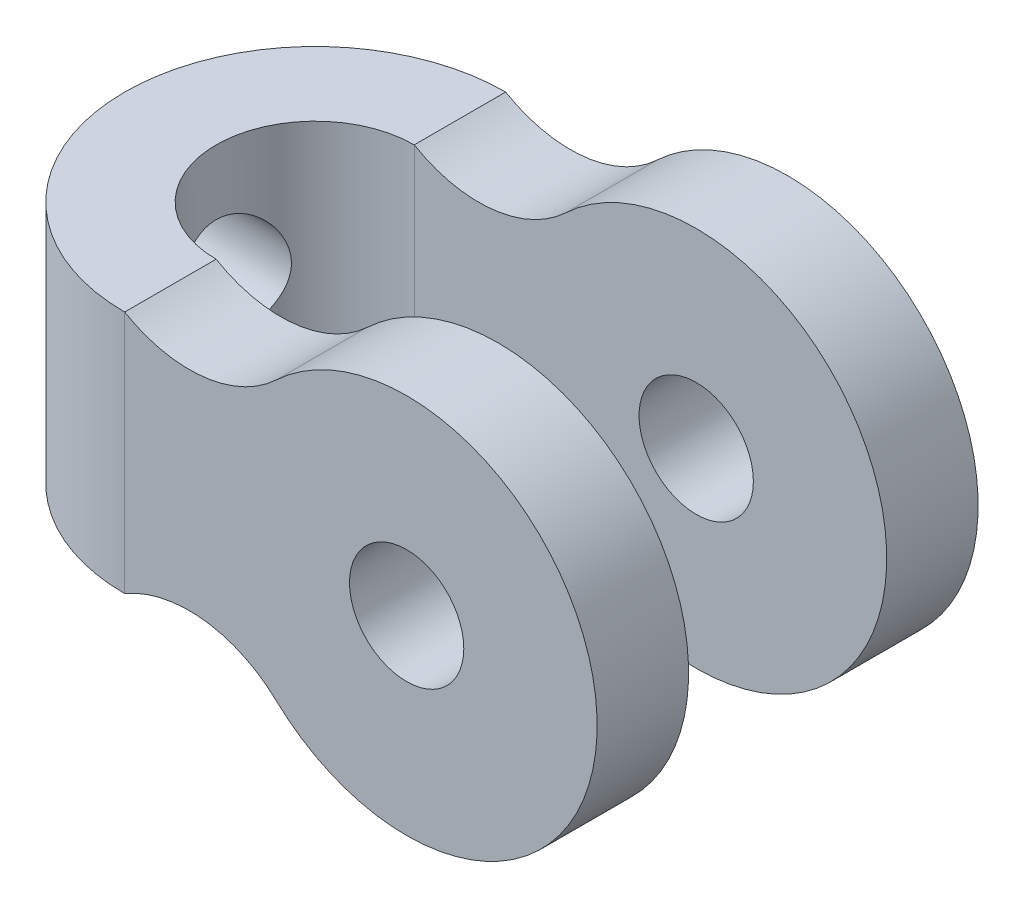
ISO-10303-21;
HEADER;
FILE_DESCRIPTION(('STEP AP214'),'2;1');
FILE_NAME('part.step','',(''),(''),'','','');
FILE_SCHEMA(('AUTOMOTIVE_DESIGN { 1 0 10303 214 1 1 1 1 }'));
ENDSEC;
DATA;
#1=APPLICATION_CONTEXT('core data for automotive mechanical design processes');
#2=APPLICATION_PROTOCOL_DEFINITION('international standard','automotive_design',2000,#1);
#3=PRODUCT_CONTEXT('',#1,'mechanical');
#4=PRODUCT('Part','Part','',(#3));
#5=PRODUCT_RELATED_PRODUCT_CATEGORY('part','',(#4));
#6=PRODUCT_DEFINITION_FORMATION('','',#4);
#7=PRODUCT_DEFINITION_CONTEXT('part definition',#1,'design');
#8=PRODUCT_DEFINITION('design','',#6,#7);
#9=PRODUCT_DEFINITION_SHAPE('','',#8);
#10=(LENGTH_UNIT() NAMED_UNIT(*) SI_UNIT(.MILLI.,.METRE.));
#11=(NAMED_UNIT(*) PLANE_ANGLE_UNIT() SI_UNIT($,.RADIAN.));
#12=(NAMED_UNIT(*) SI_UNIT($,.STERADIAN.) SOLID_ANGLE_UNIT());
#13=UNCERTAINTY_MEASURE_WITH_UNIT(LENGTH_MEASURE(1.E-05),#10,'distance_accuracy_value','');
#14=(GEOMETRIC_REPRESENTATION_CONTEXT(3) GLOBAL_UNCERTAINTY_ASSIGNED_CONTEXT((#13)) GLOBAL_UNIT_ASSIGNED_CONTEXT((#10,
#11,#12)) REPRESENTATION_CONTEXT('',''));
#15=CARTESIAN_POINT('',(0.,0.,0.));
#16=DIRECTION('',(0.,0.,1.));
#17=DIRECTION('',(1.,0.,0.));
#18=AXIS2_PLACEMENT_3D('',#15,#16,#17);
#19=CARTESIAN_POINT('',(37.,0.,13.));
#20=DIRECTION('',(0.,0.,1.));
#21=DIRECTION('',(1.,0.,0.));
#22=AXIS2_PLACEMENT_3D('',#19,#20,#21);
#23=CYLINDRICAL_SURFACE('',#22,25.);
#24=CARTESIAN_POINT('',(37.,0.,25.));
#25=DIRECTION('',(0.,0.,-1.));
#26=DIRECTION('',(-1.,0.,0.));
#27=AXIS2_PLACEMENT_3D('',#24,#25,#26);
#28=CIRCLE('',#27,25.);
#29=CARTESIAN_POINT('',(19.8821769608926,-18.2203220169624,25.));
#30=VERTEX_POINT('',#29);
#31=CARTESIAN_POINT('',(19.8821769608926,18.2203220169624,25.));
#32=VERTEX_POINT('',#31);
#33=EDGE_CURVE('E192',#30,#32,#28,.F.);
#34=ORIENTED_EDGE('',*,*,#33,.F.);
#35=DIRECTION('',(0.,0.,1.));
#36=VECTOR('',#35,1.);
#37=CARTESIAN_POINT('',(19.8821769608926,-18.2203220169624,13.));
#38=LINE('',#37,#36);
#39=CARTESIAN_POINT('',(19.8821769608926,-18.2203220169624,13.));
#40=VERTEX_POINT('',#39);
#41=EDGE_CURVE('E164',#40,#30,#38,.T.);
#42=ORIENTED_EDGE('',*,*,#41,.F.);
#43=CARTESIAN_POINT('',(37.,0.,13.));
#44=DIRECTION('',(0.,0.,1.));
#45=DIRECTION('',(1.,0.,0.));
#46=AXIS2_PLACEMENT_3D('',#43,#44,#45);
#47=CIRCLE('',#46,25.);
#48=CARTESIAN_POINT('',(19.8821769608926,18.2203220169624,13.));
#49=VERTEX_POINT('',#48);
#50=EDGE_CURVE('E220',#40,#49,#47,.T.);
#51=ORIENTED_EDGE('',*,*,#50,.T.);
#52=DIRECTION('',(0.,0.,1.));
#53=VECTOR('',#52,1.);
#54=CARTESIAN_POINT('',(19.8821769608926,18.2203220169624,13.));
#55=LINE('',#54,#53);
#56=EDGE_CURVE('E170',#49,#32,#55,.T.);
#57=ORIENTED_EDGE('',*,*,#56,.T.);
#58=EDGE_LOOP('',(#34,#42,#51,#57));
#59=FACE_BOUND('',#58,.T.);
#60=ADVANCED_FACE('F43',(#59),#23,.T.);
#61=CARTESIAN_POINT('',(0.,16.,0.));
#62=DIRECTION('',(0.,-1.,0.));
#63=DIRECTION('',(0.,0.,-1.));
#64=AXIS2_PLACEMENT_3D('',#61,#62,#63);
#65=CYLINDRICAL_SURFACE('',#64,13.);
#66=CARTESIAN_POINT('',(-10.6183802907976,0.,-7.5));
#67=CARTESIAN_POINT('',(-10.6183807732845,0.19041493864219,-7.49999966819467));
#68=CARTESIAN_POINT('',(-10.6235212171883,0.380834479385284,-7.49273748241149));
#69=CARTESIAN_POINT('',(-10.6438617045529,0.760031999546681,-7.46381371356377));
#70=CARTESIAN_POINT('',(-10.6590621824787,0.948809907710637,-7.44215150860183));
#71=CARTESIAN_POINT('',(-10.6989006729059,1.32332067001698,-7.38476397169863));
#72=CARTESIAN_POINT('',(-10.7235450117962,1.50905139570591,-7.34902921218797));
#73=CARTESIAN_POINT('',(-10.7813217849438,1.87610679062922,-7.26400278215991));
#74=CARTESIAN_POINT('',(-10.8144581546176,2.05742937425146,-7.21470482534094));
#75=CARTESIAN_POINT('',(-10.8877729954379,2.41323481189422,-7.10357591816715));
#76=CARTESIAN_POINT('',(-10.92789956285,2.58775722040373,-7.04183685006481));
#77=CARTESIAN_POINT('',(-11.0141095193745,2.93055434858108,-6.90621811969161));
#78=CARTESIAN_POINT('',(-11.0601951249362,3.09882671343176,-6.83233393728798));
#79=CARTESIAN_POINT('',(-11.1570289857365,3.42842747066833,-6.67303361847131));
#80=CARTESIAN_POINT('',(-11.207777239314,3.58975586552811,-6.58761748616676));
#81=CARTESIAN_POINT('',(-11.3126561254572,3.90490349536067,-6.40584552670437));
#82=CARTESIAN_POINT('',(-11.3667868729411,4.05872247488934,-6.30948932777393));
#83=CARTESIAN_POINT('',(-11.5448314170085,4.54194109280896,-5.98186886151761));
#84=CARTESIAN_POINT('',(-11.6731427416843,4.85606136912108,-5.7297061613543));
#85=CARTESIAN_POINT('',(-11.8642037234057,5.29401171734604,-5.31637918466528));
#86=CARTESIAN_POINT('',(-11.9276980183578,5.43453895844709,-5.1726494024848));
#87=CARTESIAN_POINT('',(-12.0528738313731,5.7040348389805,-4.87385116958035));
#88=CARTESIAN_POINT('',(-12.1145550289413,5.83300144303936,-4.71878073090548));
#89=CARTESIAN_POINT('',(-12.2405516102481,6.09056052111627,-4.38226657725949));
#90=CARTESIAN_POINT('',(-12.304535451984,6.21788504679745,-4.1997264426894));
#91=CARTESIAN_POINT('',(-12.4268192961067,6.45649492536812,-3.82274776060878));
#92=CARTESIAN_POINT('',(-12.4851218073375,6.56778736841658,-3.62831452733411));
#93=CARTESIAN_POINT('',(-12.5943838585164,6.77318727562475,-3.22868157743215));
#94=CARTESIAN_POINT('',(-12.6453461951346,6.8673012885877,-3.02348600221753));
#95=CARTESIAN_POINT('',(-12.7384034854798,7.03718531993501,-2.60370265286984));
#96=CARTESIAN_POINT('',(-12.7804997630478,7.11295807720793,-2.38911628671594));
#97=CARTESIAN_POINT('',(-12.8511543829347,7.23910516709274,-1.97192699534729));
#98=CARTESIAN_POINT('',(-12.8805885431219,7.29114841011263,-1.76997651445144));
#99=CARTESIAN_POINT('',(-12.9301624843343,7.37837334762997,-1.36133812967338));
#100=CARTESIAN_POINT('',(-12.950302773278,7.41355596358009,-1.15465048532965));
#101=CARTESIAN_POINT('',(-12.9806835689507,7.46649956855902,-0.738481152022394));
#102=CARTESIAN_POINT('',(-12.9909311034133,7.48427292511823,-0.529001553849871));
#103=CARTESIAN_POINT('',(-13.0012387635932,7.50215074414817,-0.109046725933166));
#104=CARTESIAN_POINT('',(-13.0012998132551,7.50225680909508,0.10142841178081));
#105=CARTESIAN_POINT('',(-12.9918190075501,7.48581274345954,0.497196756927199));
#106=CARTESIAN_POINT('',(-12.9833816853487,7.47117841836563,0.682599912329673));
#107=CARTESIAN_POINT('',(-12.9587382874924,7.42827085619351,1.05130069464922));
#108=CARTESIAN_POINT('',(-12.9425322127969,7.39999762079933,1.23459832182626));
#109=CARTESIAN_POINT('',(-12.9027272780067,7.33015642261091,1.59781440608292));
#110=CARTESIAN_POINT('',(-12.8791285191231,7.28858864182821,1.7777329093894));
#111=CARTESIAN_POINT('',(-12.8250679928318,7.19263086224007,2.1330575063129));
#112=CARTESIAN_POINT('',(-12.7946059494466,7.13824034781934,2.30846341815933));
#113=CARTESIAN_POINT('',(-12.7271977332188,7.01670449207594,2.65515810675736));
#114=CARTESIAN_POINT('',(-12.6902012193471,6.94945976555593,2.82640223732249));
#115=CARTESIAN_POINT('',(-12.6106632734052,6.80313068394007,3.16244205466241));
#116=CARTESIAN_POINT('',(-12.568119986805,6.72404236769158,3.32723556064202));
#117=CARTESIAN_POINT('',(-12.4334200083797,6.46998120820445,3.810740266032));
#118=CARTESIAN_POINT('',(-12.3341482448663,6.27813322215175,4.11879834222673));
#119=CARTESIAN_POINT('',(-12.1120235078011,5.83036672852847,4.73478776118259));
#120=CARTESIAN_POINT('',(-11.9877721123166,5.56963079495925,5.03867803627378));
#121=CARTESIAN_POINT('',(-11.7355475194831,5.00372696776813,5.60106376238731));
#122=CARTESIAN_POINT('',(-11.6075698656485,4.69850396243666,5.85950201702176));
#123=CARTESIAN_POINT('',(-11.4156710681088,4.19463045661562,6.22123453974022));
#124=CARTESIAN_POINT('',(-11.3487461710552,4.00952112112527,6.34215173818473));
#125=CARTESIAN_POINT('',(-11.2196388044965,3.62801777575609,6.56784437296249));
#126=CARTESIAN_POINT('',(-11.1574570159603,3.4316221525735,6.6726174936822));
#127=CARTESIAN_POINT('',(-11.0402389752531,3.02885054072663,6.86482290905135));
#128=CARTESIAN_POINT('',(-10.9851922902732,2.82248974350594,6.95228062301533));
#129=CARTESIAN_POINT('',(-10.8844744098571,2.40075844230142,7.10893121746259));
#130=CARTESIAN_POINT('',(-10.8387998581565,2.18539119700299,7.17813063898854));
#131=CARTESIAN_POINT('',(-10.7683068693668,1.79826985726795,7.28330846613391));
#132=CARTESIAN_POINT('',(-10.741108407342,1.62802156904908,7.32327016867799));
#133=CARTESIAN_POINT('',(-10.6943925611506,1.2841428773336,7.39132456729494));
#134=CARTESIAN_POINT('',(-10.6748736344111,1.11051316041919,7.41941964707608));
#135=CARTESIAN_POINT('',(-10.6442024248522,0.76111822604683,7.4633554965018));
#136=CARTESIAN_POINT('',(-10.6330432514836,0.585354888946761,7.47920635881199));
#137=CARTESIAN_POINT('',(-10.6194714222325,0.232801541741071,7.49846435645024));
#138=CARTESIAN_POINT('',(-10.6170589833592,0.0560115062717291,7.50187118303783));
#139=CARTESIAN_POINT('',(-10.6210733089797,-0.297389392710777,7.49618658229532));
#140=CARTESIAN_POINT('',(-10.6275062692243,-0.474000043832474,7.4870863944418));
#141=CARTESIAN_POINT('',(-10.6489828798288,-0.825611629774685,7.45650786858179));
#142=CARTESIAN_POINT('',(-10.6640265650146,-1.00061255808183,7.43502948051216));
#143=CARTESIAN_POINT('',(-10.7021944327085,-1.3478762615909,7.37998318477249));
#144=CARTESIAN_POINT('',(-10.7253221415322,-1.52013780751293,7.34641000106001));
#145=CARTESIAN_POINT('',(-10.7788910275016,-1.86086559721645,7.26758384002498));
#146=CARTESIAN_POINT('',(-10.8093351607168,-2.02933027677361,7.22232614123404));
#147=CARTESIAN_POINT('',(-10.8769235821627,-2.36314292441477,7.12013466551923));
#148=CARTESIAN_POINT('',(-10.9141298467574,-2.52844496687578,7.06309215519195));
#149=CARTESIAN_POINT('',(-10.993993793257,-2.85355107895792,6.93812631230225));
#150=CARTESIAN_POINT('',(-11.0366532702403,-3.01335331607886,6.87019939495599));
#151=CARTESIAN_POINT('',(-11.1711737985451,-3.48357585912023,6.65088677482425));
#152=CARTESIAN_POINT('',(-11.2696102177483,-3.78496769707846,6.48392094392949));
#153=CARTESIAN_POINT('',(-11.4929369573675,-4.40866927460059,6.08061958189599));
#154=CARTESIAN_POINT('',(-11.6194858676838,-4.72589805900425,5.83732800180829));
#155=CARTESIAN_POINT('',(-11.8092500331737,-5.16974059672925,5.43723733382179));
#156=CARTESIAN_POINT('',(-11.8725424699118,-5.31244993432602,5.29789683342313));
#157=CARTESIAN_POINT('',(-11.9977443085592,-5.58665970322304,5.00789809483656));
#158=CARTESIAN_POINT('',(-12.0596534767863,-5.71815825103709,4.85723796284391));
#159=CARTESIAN_POINT('',(-12.1870887411742,-5.98246752397188,4.52869861432382));
#160=CARTESIAN_POINT('',(-12.2523052239106,-6.11394710005013,4.34962570833819));
#161=CARTESIAN_POINT('',(-12.3775290331766,-6.36117757000874,3.97931566996771));
#162=CARTESIAN_POINT('',(-12.4375385647811,-6.47693513381053,3.78808374680637));
#163=CARTESIAN_POINT('',(-12.5506655924218,-6.69160111806925,3.39451000524366));
#164=CARTESIAN_POINT('',(-12.6037853624901,-6.79051510130219,3.19217188409198));
#165=CARTESIAN_POINT('',(-12.7015668248117,-6.97032968825142,2.77768160517893));
#166=CARTESIAN_POINT('',(-12.746229688782,-7.05123278767586,2.56553081205338));
#167=CARTESIAN_POINT('',(-12.8225030842756,-7.18815339623863,2.15042225396955));
#168=CARTESIAN_POINT('',(-12.8548728002512,-7.24564567161215,1.9480903408532));
#169=CARTESIAN_POINT('',(-12.910346486563,-7.34361492984538,1.53809311730334));
#170=CARTESIAN_POINT('',(-12.9334508818246,-7.38409269302724,1.33042805192327));
#171=CARTESIAN_POINT('',(-12.9696909071666,-7.4473858064178,0.911723943201735));
#172=CARTESIAN_POINT('',(-12.9828342433095,-7.47021481031298,0.700687637244094));
#173=CARTESIAN_POINT('',(-12.9987749140446,-7.49788508261704,0.277057522801693));
#174=CARTESIAN_POINT('',(-13.0015733157909,-7.50272820639845,0.064463877234799));
#175=CARTESIAN_POINT('',(-12.9970339320448,-7.49485764700523,-0.334763596103743));
#176=CARTESIAN_POINT('',(-12.9908707657702,-7.48417856911632,-0.521455025342119));
#177=CARTESIAN_POINT('',(-12.9706208706599,-7.44897407820879,-0.893095083989642));
#178=CARTESIAN_POINT('',(-12.9565342139207,-7.42444879117769,-1.07804372924092));
#179=CARTESIAN_POINT('',(-12.920770099743,-7.36185833862864,-1.44487550580922));
#180=CARTESIAN_POINT('',(-12.8990928679165,-7.32379357553909,-1.62675872807031));
#181=CARTESIAN_POINT('',(-12.8486446719631,-7.23457131967984,-1.98627484195547));
#182=CARTESIAN_POINT('',(-12.8198734557184,-7.18341336158008,-2.1639075822727));
#183=CARTESIAN_POINT('',(-12.7559206417195,-7.06864767231926,-2.51356571122269));
#184=CARTESIAN_POINT('',(-12.7207501988546,-7.00506159129491,-2.68560025269082));
#185=CARTESIAN_POINT('',(-12.6447006661188,-6.86599091290037,-3.02350672225573));
#186=CARTESIAN_POINT('',(-12.6038196785944,-6.79050235917817,-3.18937657849173));
#187=CARTESIAN_POINT('',(-12.4738165286567,-6.54713770566763,-3.67648840684472));
#188=CARTESIAN_POINT('',(-12.3772896621439,-6.36228481179263,-3.98746694772168));
#189=CARTESIAN_POINT('',(-12.160392680129,-5.92991787215349,-4.60923998766357));
#190=CARTESIAN_POINT('',(-12.0385679429097,-5.67774917190868,-4.91625561607505));
#191=CARTESIAN_POINT('',(-11.7897326234057,-5.12909624806626,-5.48624850647104));
#192=CARTESIAN_POINT('',(-11.6627160089419,-4.83255934657986,-5.74917262127669));
#193=CARTESIAN_POINT('',(-11.4703920901867,-4.34118298631901,-6.11983847563));
#194=CARTESIAN_POINT('',(-11.4027761188206,-4.15980833980046,-6.24457157532889));
#195=CARTESIAN_POINT('',(-11.2716579490527,-3.78562810488325,-6.47824413878931));
#196=CARTESIAN_POINT('',(-11.2081563262865,-3.59282092416278,-6.58718139519354));
#197=CARTESIAN_POINT('',(-11.0876060692604,-3.19695232669748,-6.78813090992248));
#198=CARTESIAN_POINT('',(-11.030549877751,-2.99390333133593,-6.88016307041553));
#199=CARTESIAN_POINT('',(-10.9251178485485,-2.57847007109373,-7.04638189554003));
#200=CARTESIAN_POINT('',(-10.8767393302622,-2.3660887143699,-7.12057407348521));
#201=CARTESIAN_POINT('',(-10.7996470938055,-1.97759480811,-7.23681160635666));
#202=CARTESIAN_POINT('',(-10.768935062906,-1.80291074893914,-7.2823269127617));
#203=CARTESIAN_POINT('',(-10.7154452477423,-1.44956481954899,-7.36080808911576));
#204=CARTESIAN_POINT('',(-10.6926658361999,-1.27090377316906,-7.39377653302634));
#205=CARTESIAN_POINT('',(-10.6558800290025,-0.910932746870917,-7.44669480155317));
#206=CARTESIAN_POINT('',(-10.6418654821224,-0.729625389090451,-7.46665672281359));
#207=CARTESIAN_POINT('',(-10.6231151706042,-0.365546811719532,-7.49330978284867));
#208=CARTESIAN_POINT('',(-10.6183798276681,-0.182775525978537,-7.50000031849336));
#209=CARTESIAN_POINT('',(-10.6183802907976,0.,-7.5));
#210=B_SPLINE_CURVE_WITH_KNOTS('',3,(#66,#67,#68,#69,#70,#71,#72,#73,#74,#75,#76,#77,#78,#79,
#80,#81,#82,#83,#84,#85,#86,#87,#88,#89,#90,#91,#92,#93,#94,#95,#96,#97,#98,#99,#100,#101,#102,
#103,#104,#105,#106,#107,#108,#109,#110,#111,#112,#113,#114,#115,#116,#117,#118,#119,#120,#121,
#122,#123,#124,#125,#126,#127,#128,#129,#130,#131,#132,#133,#134,#135,#136,#137,#138,#139,#140,
#141,#142,#143,#144,#145,#146,#147,#148,#149,#150,#151,#152,#153,#154,#155,#156,#157,#158,#159,
#160,#161,#162,#163,#164,#165,#166,#167,#168,#169,#170,#171,#172,#173,#174,#175,#176,#177,#178,
#179,#180,#181,#182,#183,#184,#185,#186,#187,#188,#189,#190,#191,#192,#193,#194,#195,#196,#197,
#198,#199,#200,#201,#202,#203,#204,#205,#206,#207,#208,#209),.UNSPECIFIED.,.T.,.F.,(4,2,2,2,2,2,
2,2,2,2,2,2,2,2,2,2,2,2,2,2,2,2,2,2,2,2,2,2,2,2,2,2,2,2,2,2,2,2,2,2,2,2,2,2,2,2,2,2,2,2,2,2,2,2,
2,2,2,2,2,2,2,2,2,2,2,2,2,2,2,2,2,4),(0.,0.571047958519108,1.14212058063765,1.71357643172915,
2.28529758996677,2.85294169157579,3.4207975376151,3.98865318134494,4.55652812810099,
5.81875278642569,6.45070375839378,7.08276577443935,7.77658944753256,8.47010533012133,
9.16335627416883,9.85650363152076,10.4874553426037,11.1183725675162,11.7488412633362,
12.3792527737292,12.9371007909577,13.4949487393074,14.0527890506596,14.6106517971715,
15.1730163044602,15.7355693194164,16.8599613721458,18.1129026768771,19.3674095618049,
20.0597007266966,20.7520910975976,21.4434573654992,22.1345756137431,22.6649609821717,
23.1952397586928,23.7250809691323,24.2549353250107,24.7851610059546,25.3153888313901,
25.8458482356629,26.3765223238945,26.9123308668427,27.4483162426421,28.519792718058,
29.7724549393759,30.3997303429854,31.0271109261444,31.7208217412166,32.4142373302951,
33.1074234652885,33.8005134879209,34.4380576082285,35.0755724861997,35.7125936658323,
36.3495491303358,36.9101659209783,37.4707776106157,38.0313726388099,38.5919875932289,
39.1516345077659,39.7114678412309,40.8303898228461,42.0723244640874,43.3157455168981,
44.0058560488693,44.6960629261525,45.3854519489514,46.0746276465965,46.6233639644327,
47.1719876494464,47.7201003589571,48.2682379773686),.UNSPECIFIED.);
#211=CARTESIAN_POINT('',(-10.6183802907976,0.,-7.5));
#212=VERTEX_POINT('',#211);
#213=EDGE_CURVE('E389',#212,#212,#210,.T.);
#214=ORIENTED_EDGE('',*,*,#213,.F.);
#215=EDGE_LOOP('',(#214));
#216=FACE_BOUND('',#215,.T.);
#217=CARTESIAN_POINT('',(0.,-16.,0.));
#218=DIRECTION('',(0.,1.,0.));
#219=DIRECTION('',(0.,0.,1.));
#220=AXIS2_PLACEMENT_3D('',#217,#218,#219);
#221=CIRCLE('',#220,13.);
#222=CARTESIAN_POINT('',(0.,-16.,-13.));
#223=VERTEX_POINT('',#222);
#224=CARTESIAN_POINT('',(0.,-16.,13.));
#225=VERTEX_POINT('',#224);
#226=EDGE_CURVE('E148',#223,#225,#221,.T.);
#227=ORIENTED_EDGE('',*,*,#226,.F.);
#228=DIRECTION('',(0.,-1.,0.));
#229=VECTOR('',#228,1.);
#230=CARTESIAN_POINT('',(0.,16.,-13.));
#231=LINE('',#230,#229);
#232=CARTESIAN_POINT('',(0.,16.,-13.));
#233=VERTEX_POINT('',#232);
#234=EDGE_CURVE('E57',#233,#223,#231,.T.);
#235=ORIENTED_EDGE('',*,*,#234,.F.);
#236=CARTESIAN_POINT('',(0.,16.,0.));
#237=DIRECTION('',(0.,1.,0.));
#238=DIRECTION('',(0.,0.,1.));
#239=AXIS2_PLACEMENT_3D('',#236,#237,#238);
#240=CIRCLE('',#239,13.);
#241=CARTESIAN_POINT('',(0.,16.,13.));
#242=VERTEX_POINT('',#241);
#243=EDGE_CURVE('E140',#233,#242,#240,.T.);
#244=ORIENTED_EDGE('',*,*,#243,.T.);
#245=DIRECTION('',(0.,-1.,0.));
#246=VECTOR('',#245,1.);
#247=CARTESIAN_POINT('',(0.,16.,13.));
#248=LINE('',#247,#246);
#249=EDGE_CURVE('E176',#242,#225,#248,.T.);
#250=ORIENTED_EDGE('',*,*,#249,.T.);
#251=EDGE_LOOP('',(#227,#235,#244,#250));
#252=FACE_BOUND('',#251,.T.);
#253=ADVANCED_FACE('F45',(#216,#252),#65,.F.);
#254=CARTESIAN_POINT('',(0.,16.,0.));
#255=DIRECTION('',(0.,-1.,0.));
#256=DIRECTION('',(0.,0.,-1.));
#257=AXIS2_PLACEMENT_3D('',#254,#255,#256);
#258=CYLINDRICAL_SURFACE('',#257,25.);
#259=CARTESIAN_POINT('',(-25.,-7.5,0.));
#260=CARTESIAN_POINT('',(-24.9999997387093,-7.49999958873744,-0.20572936877928));
#261=CARTESIAN_POINT('',(-24.9974544667338,-7.49152807475558,-0.411465831535254));
#262=CARTESIAN_POINT('',(-24.9873429572389,-7.45771851212328,-0.821427710156372));
#263=CARTESIAN_POINT('',(-24.979776490633,-7.43237969392028,-1.0256530566486));
#264=CARTESIAN_POINT('',(-24.9598298392335,-7.36506198897937,-1.43111710809401));
#265=CARTESIAN_POINT('',(-24.9474493245922,-7.32308196201924,-1.63235560741404));
#266=CARTESIAN_POINT('',(-24.918207039206,-7.22283446114039,-2.03047327493865));
#267=CARTESIAN_POINT('',(-24.901343610904,-7.16456096229754,-2.2273508014443));
#268=CARTESIAN_POINT('',(-24.8636236585512,-7.03233895758803,-2.61496608898178));
#269=CARTESIAN_POINT('',(-24.8427747095386,-6.95842015967178,-2.80571470813012));
#270=CARTESIAN_POINT('',(-24.7976165834664,-6.7954319444745,-3.18023152761331));
#271=CARTESIAN_POINT('',(-24.7733061064176,-6.70635683272393,-3.3639970724324));
#272=CARTESIAN_POINT('',(-24.6961258709879,-6.41741890217033,-3.9028968365555));
#273=CARTESIAN_POINT('',(-24.6389706824167,-6.19572053156255,-4.2459924930959));
#274=CARTESIAN_POINT('',(-24.5175228332811,-5.69380756937393,-4.89945628260249));
#275=CARTESIAN_POINT('',(-24.453083830256,-5.41222812637477,-5.20874876842761));
#276=CARTESIAN_POINT('',(-24.3572356846049,-4.95451799568009,-5.63438867316526));
#277=CARTESIAN_POINT('',(-24.3254023912414,-4.79595137800807,-5.76995575273776));
#278=CARTESIAN_POINT('',(-24.2628688644801,-4.46796267803007,-6.02749720979437));
#279=CARTESIAN_POINT('',(-24.2321682141076,-4.29854465472853,-6.14947662356303));
#280=CARTESIAN_POINT('',(-24.1720742886242,-3.94589029825538,-6.38165723915321));
#281=CARTESIAN_POINT('',(-24.1427271344006,-3.76242618681867,-6.49152422630404));
#282=CARTESIAN_POINT('',(-24.0870056696098,-3.38649865222216,-6.69532049323419));
#283=CARTESIAN_POINT('',(-24.0606302713012,-3.19403855856468,-6.78925561090326));
#284=CARTESIAN_POINT('',(-24.0116591700552,-2.80137736808001,-6.96047121789365));
#285=CARTESIAN_POINT('',(-23.9890634885817,-2.60117622730217,-7.03775161263955));
#286=CARTESIAN_POINT('',(-23.9483776131669,-2.19447382063703,-7.17498002551062));
#287=CARTESIAN_POINT('',(-23.9302872587357,-1.98797277946088,-7.23492866104505));
#288=CARTESIAN_POINT('',(-23.8996443649906,-1.57606890496715,-7.33550863488258));
#289=CARTESIAN_POINT('',(-23.8869510239055,-1.3707970470539,-7.37663359600348));
#290=CARTESIAN_POINT('',(-23.8667919187207,-0.957284784069786,-7.44159959786525));
#291=CARTESIAN_POINT('',(-23.8593259688078,-0.749044484783927,-7.46544125296127));
#292=CARTESIAN_POINT('',(-23.8498656440743,-0.331216759863733,-7.49560936672585));
#293=CARTESIAN_POINT('',(-23.8478701692626,-0.121629613547333,-7.50193934660578));
#294=CARTESIAN_POINT('',(-23.8494134610353,0.297315995670383,-7.49703176128155));
#295=CARTESIAN_POINT('',(-23.8529521082585,0.506674463406428,-7.48579457496972));
#296=CARTESIAN_POINT('',(-23.8652191979764,0.915974207495902,-7.44659064244469));
#297=CARTESIAN_POINT('',(-23.8737544360965,1.11598129684939,-7.41924647591029));
#298=CARTESIAN_POINT('',(-23.8956008797221,1.51295523472682,-7.3485797932839));
#299=CARTESIAN_POINT('',(-23.9089136782339,1.70992104630652,-7.3052519475377));
#300=CARTESIAN_POINT('',(-23.9399159878258,2.09934402861037,-7.20300430851475));
#301=CARTESIAN_POINT('',(-23.9576042240451,2.29180249478027,-7.14408905655662));
#302=CARTESIAN_POINT('',(-23.9968558467266,2.67108383112157,-7.01111349668661));
#303=CARTESIAN_POINT('',(-24.0184206964623,2.85790454205031,-6.93704746847458));
#304=CARTESIAN_POINT('',(-24.0651252156469,3.22710930200351,-6.77326301936971));
#305=CARTESIAN_POINT('',(-24.0903086714519,3.40940112154872,-6.68334926852301));
#306=CARTESIAN_POINT('',(-24.1433341783777,3.76585515047791,-6.48918645688073));
#307=CARTESIAN_POINT('',(-24.1711771400495,3.94001454490987,-6.38493248092123));
#308=CARTESIAN_POINT('',(-24.2287599493092,4.27910403458712,-6.1628198985473));
#309=CARTESIAN_POINT('',(-24.2584998559677,4.44403384212376,-6.04496086838063));
#310=CARTESIAN_POINT('',(-24.3190903696216,4.76369509186997,-5.79639580550814));
#311=CARTESIAN_POINT('',(-24.3499410080922,4.91842624472502,-5.66568940856087));
#312=CARTESIAN_POINT('',(-24.4132571587227,5.22304964855026,-5.38648407256465));
#313=CARTESIAN_POINT('',(-24.4457360934279,5.37246605566325,-5.23746854116016));
#314=CARTESIAN_POINT('',(-24.5101228223224,5.65822395788626,-4.92736681553845));
#315=CARTESIAN_POINT('',(-24.5420307974826,5.79456965779628,-4.76628453305944));
#316=CARTESIAN_POINT('',(-24.6044239714678,6.05338444200731,-4.43295367759993));
#317=CARTESIAN_POINT('',(-24.6349085356572,6.17584737069483,-4.26070020412312));
#318=CARTESIAN_POINT('',(-24.6935891394486,6.4059125570832,-3.90626478461736));
#319=CARTESIAN_POINT('',(-24.7217860748174,6.51352064318826,-3.72408677190493));
#320=CARTESIAN_POINT('',(-24.7753141715796,6.7138348498094,-3.34960172200364));
#321=CARTESIAN_POINT('',(-24.8006234400515,6.8064291155219,-3.15723166516043));
#322=CARTESIAN_POINT('',(-24.8474127214962,6.97498934178343,-2.76497276500567));
#323=CARTESIAN_POINT('',(-24.8688941908724,7.05096162919023,-2.56508681655161));
#324=CARTESIAN_POINT('',(-24.9074192341517,7.1856593933389,-2.15917205270828));
#325=CARTESIAN_POINT('',(-24.924462947231,7.24438541096311,-1.95314343019056));
#326=CARTESIAN_POINT('',(-24.9536132069595,7.34405113456182,-1.5364868020148));
#327=CARTESIAN_POINT('',(-24.9657199339043,7.38499149006096,-1.32585896461318));
#328=CARTESIAN_POINT('',(-24.9842982854925,7.44755116065808,-0.909255698841177));
#329=CARTESIAN_POINT('',(-24.9909565624248,7.46981118341934,-0.703384610254433));
#330=CARTESIAN_POINT('',(-24.9991662453924,7.49723188929537,-0.290406947188554));
#331=CARTESIAN_POINT('',(-25.0007177751984,7.50239298683127,-0.0833004027746441));
#332=CARTESIAN_POINT('',(-24.9986707577265,7.49556866355194,0.330578250504444));
#333=CARTESIAN_POINT('',(-24.9950728313054,7.48358530979956,0.537350396678168));
#334=CARTESIAN_POINT('',(-24.9828285304966,7.4425871577153,0.949046411046284));
#335=CARTESIAN_POINT('',(-24.9741821918165,7.41357247984682,1.15397029230313));
#336=CARTESIAN_POINT('',(-24.9523339609458,7.33963110490564,1.55582786425802));
#337=CARTESIAN_POINT('',(-24.9392404644237,7.29508240441682,1.75283719426588));
#338=CARTESIAN_POINT('',(-24.908801273421,7.19033319530745,2.14238229994045));
#339=CARTESIAN_POINT('',(-24.891454153274,7.13012743857692,2.33491655198149));
#340=CARTESIAN_POINT('',(-24.8529645483107,6.99457404288099,2.71412375911613));
#341=CARTESIAN_POINT('',(-24.8318230886814,6.91923049331822,2.90079828147418));
#342=CARTESIAN_POINT('',(-24.7862727845975,6.75393439590319,3.26722911141926));
#343=CARTESIAN_POINT('',(-24.7618627095438,6.66397634311254,3.44698278040032));
#344=CARTESIAN_POINT('',(-24.7098092659016,6.46790594647627,3.8024094976386));
#345=CARTESIAN_POINT('',(-24.6821049297225,6.361472401944,3.97789642432022));
#346=CARTESIAN_POINT('',(-24.6246392958394,6.13472806549552,4.319390715712));
#347=CARTESIAN_POINT('',(-24.5948772886033,6.01441247707174,4.48539477411423));
#348=CARTESIAN_POINT('',(-24.5340739008742,5.76072425110561,4.80686840733673));
#349=CARTESIAN_POINT('',(-24.5030324554766,5.6273509506849,4.96233744666521));
#350=CARTESIAN_POINT('',(-24.4404753482913,5.34839303934202,5.26180280400988));
#351=CARTESIAN_POINT('',(-24.4089596773737,5.20280819307404,5.4057989008106));
#352=CARTESIAN_POINT('',(-24.3451299534876,4.89477986159403,5.68648540947414));
#353=CARTESIAN_POINT('',(-24.3128288218739,4.73191467882113,5.82271642959704));
#354=CARTESIAN_POINT('',(-24.2495307172795,4.39512010875983,6.08094838385399));
#355=CARTESIAN_POINT('',(-24.2185333069495,4.22119448181658,6.2029541147716));
#356=CARTESIAN_POINT('',(-24.1587207755985,3.86327906477721,6.43196921224757));
#357=CARTESIAN_POINT('',(-24.129906488346,3.67928547531241,6.53897286241557));
#358=CARTESIAN_POINT('',(-24.0753474245028,3.30258424632967,6.73707682110122));
#359=CARTESIAN_POINT('',(-24.0496013881702,3.10988022821668,6.82818366360478));
#360=CARTESIAN_POINT('',(-24.0020625185244,2.71784702752027,6.9934514018465));
#361=CARTESIAN_POINT('',(-23.9802532104634,2.51854978979287,7.06768327278795));
#362=CARTESIAN_POINT('',(-23.9411502520658,2.11404233812713,7.1990293893985));
#363=CARTESIAN_POINT('',(-23.9238548246498,1.90883448658811,7.25615037280262));
#364=CARTESIAN_POINT('',(-23.8943329886842,1.49397108420576,7.3527823140128));
#365=CARTESIAN_POINT('',(-23.8821061245656,1.28431593487248,7.39229485451183));
#366=CARTESIAN_POINT('',(-23.8631277726518,0.862160223015376,7.45333211453091));
#367=CARTESIAN_POINT('',(-23.8563760762277,0.649659769224285,7.47485751944365));
#368=CARTESIAN_POINT('',(-23.8487382467039,0.232389416899943,7.49918896554611));
#369=CARTESIAN_POINT('',(-23.8476192051384,0.0276667726656888,7.50273834922255));
#370=CARTESIAN_POINT('',(-23.8506521173363,-0.381343369421288,7.49309149993803));
#371=CARTESIAN_POINT('',(-23.854803992758,-0.585630873696294,7.4798955158636));
#372=CARTESIAN_POINT('',(-23.8682486193947,-0.992263489666761,7.43688193028716));
#373=CARTESIAN_POINT('',(-23.87754110025,-1.19460870294375,7.40706520291881));
#374=CARTESIAN_POINT('',(-23.9009795631153,-1.5959175515851,7.33108132989853));
#375=CARTESIAN_POINT('',(-23.9151255676597,-1.79488117124451,7.28491410833274));
#376=CARTESIAN_POINT('',(-23.9476351796166,-2.18555501988675,7.17731719613041));
#377=CARTESIAN_POINT('',(-23.965943206907,-2.37732514801586,7.11608783340887));
#378=CARTESIAN_POINT('',(-24.0063523493272,-2.75503697265395,6.97855154004263));
#379=CARTESIAN_POINT('',(-24.0284547349645,-2.94097669215846,6.90223955781644));
#380=CARTESIAN_POINT('',(-24.075825830913,-3.30576715054397,6.7351425723968));
#381=CARTESIAN_POINT('',(-24.1010939338728,-3.48461924056503,6.64436034445149));
#382=CARTESIAN_POINT('',(-24.1541240236649,-3.83426456333538,6.44891807891773));
#383=CARTESIAN_POINT('',(-24.1818869009315,-4.00505488523989,6.34425307989752));
#384=CARTESIAN_POINT('',(-24.24020741916,-4.34355301293501,6.11772102839548));
#385=CARTESIAN_POINT('',(-24.2708298986256,-4.51092444104915,5.99536780898771));
#386=CARTESIAN_POINT('',(-24.3331165612597,-4.83485596892158,5.73733812480063));
#387=CARTESIAN_POINT('',(-24.3647807720269,-4.99141578190507,5.60166130684794));
#388=CARTESIAN_POINT('',(-24.4283088215337,-5.2928242042194,5.31778959117124));
#389=CARTESIAN_POINT('',(-24.4601727370338,-5.43766796956597,5.16958956699919));
#390=CARTESIAN_POINT('',(-24.5232269902538,-5.71461649778665,4.86168907350529));
#391=CARTESIAN_POINT('',(-24.5544175495417,-5.84672550218907,4.70199246448851));
#392=CARTESIAN_POINT('',(-24.6162141640073,-6.1011210154075,4.36713104334013));
#393=CARTESIAN_POINT('',(-24.6467754229572,-6.22299981824169,4.19164788017676));
#394=CARTESIAN_POINT('',(-24.705448866266,-6.45146436335427,3.83069328161896));
#395=CARTESIAN_POINT('',(-24.7335619375534,-6.55805565311752,3.64522550318335));
#396=CARTESIAN_POINT('',(-24.7865496000415,-6.75515006844103,3.26553085348695));
#397=CARTESIAN_POINT('',(-24.8114248383513,-6.84565641004405,3.07130574293528));
#398=CARTESIAN_POINT('',(-24.8572274392473,-7.00984859957112,2.67543080317175));
#399=CARTESIAN_POINT('',(-24.8781551827679,-7.08353607066591,2.47378169262514));
#400=CARTESIAN_POINT('',(-24.9134552801456,-7.20647857103736,2.08648249663028));
#401=CARTESIAN_POINT('',(-24.9282899007991,-7.25750606742063,1.90143499459265));
#402=CARTESIAN_POINT('',(-24.9539809334783,-7.3452657099994,1.5277130653917));
#403=CARTESIAN_POINT('',(-24.9648375854447,-7.38199871840951,1.33903885770454));
#404=CARTESIAN_POINT('',(-24.982314425005,-7.44088878551197,0.95922266927446));
#405=CARTESIAN_POINT('',(-24.9889343724353,-7.46304501790124,0.7680805492609));
#406=CARTESIAN_POINT('',(-24.997776505544,-7.49259821130893,0.38462739462913));
#407=CARTESIAN_POINT('',(-25.0000002442558,-7.5000003844502,0.192316796885705));
#408=CARTESIAN_POINT('',(-25.,-7.5,0.));
#409=B_SPLINE_CURVE_WITH_KNOTS('',3,(#259,#260,#261,#262,#263,#264,#265,#266,#267,#268,#269,
#270,#271,#272,#273,#274,#275,#276,#277,#278,#279,#280,#281,#282,#283,#284,#285,#286,#287,#288,
#289,#290,#291,#292,#293,#294,#295,#296,#297,#298,#299,#300,#301,#302,#303,#304,#305,#306,#307,
#308,#309,#310,#311,#312,#313,#314,#315,#316,#317,#318,#319,#320,#321,#322,#323,#324,#325,#326,
#327,#328,#329,#330,#331,#332,#333,#334,#335,#336,#337,#338,#339,#340,#341,#342,#343,#344,#345,
#346,#347,#348,#349,#350,#351,#352,#353,#354,#355,#356,#357,#358,#359,#360,#361,#362,#363,#364,
#365,#366,#367,#368,#369,#370,#371,#372,#373,#374,#375,#376,#377,#378,#379,#380,#381,#382,#383,
#384,#385,#386,#387,#388,#389,#390,#391,#392,#393,#394,#395,#396,#397,#398,#399,#400,#401,#402,
#403,#404,#405,#406,#407,#408),.UNSPECIFIED.,.T.,.F.,(4,2,2,2,2,2,2,2,2,2,2,2,2,2,2,2,2,2,2,2,2,
2,2,2,2,2,2,2,2,2,2,2,2,2,2,2,2,2,2,2,2,2,2,2,2,2,2,2,2,2,2,2,2,2,2,2,2,2,2,2,2,2,2,2,2,2,2,2,2,
2,2,2,2,2,4),(0.,0.617011014084921,1.23405018056197,1.85113163263338,2.46844156866762,
3.08458968130544,3.70096980389295,4.93260224445208,6.19608156979815,6.82858532893179,
7.4608538641903,8.10762051119977,8.75414965009408,9.40068246026767,10.0471922361636,
10.6756103415585,11.304006108008,11.9322755087512,12.5605313590348,13.1659639935605,
13.7715986884165,14.3770571283423,14.9827445874104,15.5964989646348,16.2104642350319,
16.8244486335694,17.4384504444769,18.0782287707322,18.7178005870157,19.357654888987,
19.9972574216116,20.6414255082747,21.2853479756983,21.9292502460878,22.573128999469,
23.1938985328161,23.8146530206626,24.4353326720282,25.0560079333493,25.6625274932798,
26.2692506159498,26.8758100551044,27.4825985028951,28.1032039409232,28.7240244556025,
29.3448765027644,29.9657405179864,30.6092972595381,31.2526363615572,31.8962199390125,
32.5395383611583,33.1800987847127,33.8204066429376,34.4606569370019,35.1008828334693,
35.7144046773518,36.3279174025609,36.9413978643795,37.5548811745697,38.1606087791624,
38.7665396033302,39.3723543555586,39.9783862004705,40.6063948225765,41.2344200960269,
41.8627037124137,42.4907773399551,43.1374850516323,43.7839574910374,44.4303005282366,
45.0765811611782,45.6535719780474,46.2305279866003,46.8075166978202,47.3843015417932),.UNSPECIFIED.);
#410=CARTESIAN_POINT('',(-25.,-7.5,0.));
#411=VERTEX_POINT('',#410);
#412=EDGE_CURVE('E11',#411,#411,#409,.T.);
#413=ORIENTED_EDGE('',*,*,#412,.T.);
#414=EDGE_LOOP('',(#413));
#415=FACE_BOUND('',#414,.T.);
#416=CARTESIAN_POINT('',(0.,-16.,0.));
#417=DIRECTION('',(0.,1.,0.));
#418=DIRECTION('',(0.,0.,1.));
#419=AXIS2_PLACEMENT_3D('',#416,#417,#418);
#420=CIRCLE('',#419,25.);
#421=CARTESIAN_POINT('',(0.,-16.,-25.));
#422=VERTEX_POINT('',#421);
#423=CARTESIAN_POINT('',(0.,-16.,25.));
#424=VERTEX_POINT('',#423);
#425=EDGE_CURVE('E160',#422,#424,#420,.T.);
#426=ORIENTED_EDGE('',*,*,#425,.T.);
#427=DIRECTION('',(0.,-1.,0.));
#428=VECTOR('',#427,1.);
#429=CARTESIAN_POINT('',(0.,16.,25.));
#430=LINE('',#429,#428);
#431=CARTESIAN_POINT('',(0.,16.,25.));
#432=VERTEX_POINT('',#431);
#433=EDGE_CURVE('E64',#432,#424,#430,.T.);
#434=ORIENTED_EDGE('',*,*,#433,.F.);
#435=CARTESIAN_POINT('',(0.,16.,0.));
#436=DIRECTION('',(0.,1.,0.));
#437=DIRECTION('',(0.,0.,1.));
#438=AXIS2_PLACEMENT_3D('',#435,#436,#437);
#439=CIRCLE('',#438,25.);
#440=CARTESIAN_POINT('',(0.,16.,-25.));
#441=VERTEX_POINT('',#440);
#442=EDGE_CURVE('E139',#441,#432,#439,.T.);
#443=ORIENTED_EDGE('',*,*,#442,.F.);
#444=DIRECTION('',(0.,-1.,0.));
#445=VECTOR('',#444,1.);
#446=CARTESIAN_POINT('',(0.,16.,-25.));
#447=LINE('',#446,#445);
#448=EDGE_CURVE('E151',#441,#422,#447,.T.);
#449=ORIENTED_EDGE('',*,*,#448,.T.);
#450=EDGE_LOOP('',(#426,#434,#443,#449));
#451=FACE_BOUND('',#450,.T.);
#452=ADVANCED_FACE('F252',(#415,#451),#258,.T.);
#453=CARTESIAN_POINT('',(0.,16.,0.));
#454=DIRECTION('',(0.,1.,0.));
#455=DIRECTION('',(0.,0.,1.));
#456=AXIS2_PLACEMENT_3D('',#453,#454,#455);
#457=PLANE('',#456);
#458=ORIENTED_EDGE('',*,*,#243,.F.);
#459=DIRECTION('',(0.,0.,1.));
#460=VECTOR('',#459,1.);
#461=CARTESIAN_POINT('',(0.,16.,0.));
#462=LINE('',#461,#460);
#463=EDGE_CURVE('E130',#441,#233,#462,.T.);
#464=ORIENTED_EDGE('',*,*,#463,.F.);
#465=ORIENTED_EDGE('',*,*,#442,.T.);
#466=EDGE_CURVE('E142',#242,#432,#462,.T.);
#467=ORIENTED_EDGE('',*,*,#466,.F.);
#468=EDGE_LOOP('',(#458,#464,#465,#467));
#469=FACE_BOUND('',#468,.T.);
#470=ADVANCED_FACE('F153',(#469),#457,.T.);
#471=CARTESIAN_POINT('',(0.,-16.,0.));
#472=DIRECTION('',(0.,1.,0.));
#473=DIRECTION('',(0.,0.,1.));
#474=AXIS2_PLACEMENT_3D('',#471,#472,#473);
#475=PLANE('',#474);
#476=ORIENTED_EDGE('',*,*,#226,.T.);
#477=DIRECTION('',(0.,0.,1.));
#478=VECTOR('',#477,1.);
#479=CARTESIAN_POINT('',(0.,-16.,0.));
#480=LINE('',#479,#478);
#481=EDGE_CURVE('E156',#225,#424,#480,.T.);
#482=ORIENTED_EDGE('',*,*,#481,.T.);
#483=ORIENTED_EDGE('',*,*,#425,.F.);
#484=EDGE_CURVE('E162',#422,#223,#480,.T.);
#485=ORIENTED_EDGE('',*,*,#484,.T.);
#486=EDGE_LOOP('',(#476,#482,#483,#485));
#487=FACE_BOUND('',#486,.T.);
#488=ADVANCED_FACE('F261',(#487),#475,.F.);
#489=CARTESIAN_POINT('',(8.45931673420997,30.3788886296337,13.));
#490=DIRECTION('',(0.,0.,1.));
#491=DIRECTION('',(1.,0.,0.));
#492=AXIS2_PLACEMENT_3D('',#489,#490,#491);
#493=CYLINDRICAL_SURFACE('',#492,16.6826999563348);
#494=CARTESIAN_POINT('',(8.45931673420997,30.3788886296337,25.));
#495=DIRECTION('',(0.,0.,-1.));
#496=DIRECTION('',(-1.,0.,0.));
#497=AXIS2_PLACEMENT_3D('',#494,#495,#496);
#498=CIRCLE('',#497,16.6826999563348);
#499=EDGE_CURVE('E205',#32,#432,#498,.T.);
#500=ORIENTED_EDGE('',*,*,#499,.F.);
#501=ORIENTED_EDGE('',*,*,#56,.F.);
#502=CARTESIAN_POINT('',(8.45931673420997,30.3788886296337,13.));
#503=DIRECTION('',(0.,0.,-1.));
#504=DIRECTION('',(-1.,0.,0.));
#505=AXIS2_PLACEMENT_3D('',#502,#503,#504);
#506=CIRCLE('',#505,16.6826999563348);
#507=EDGE_CURVE('E212',#49,#242,#506,.T.);
#508=ORIENTED_EDGE('',*,*,#507,.T.);
#509=ORIENTED_EDGE('',*,*,#466,.T.);
#510=EDGE_LOOP('',(#500,#501,#508,#509));
#511=FACE_BOUND('',#510,.T.);
#512=ADVANCED_FACE('F258',(#511),#493,.F.);
#513=CARTESIAN_POINT('',(8.45931673420997,-30.3788886296337,13.));
#514=DIRECTION('',(0.,0.,1.));
#515=DIRECTION('',(1.,0.,0.));
#516=AXIS2_PLACEMENT_3D('',#513,#514,#515);
#517=CYLINDRICAL_SURFACE('',#516,16.6826999563348);
#518=CARTESIAN_POINT('',(8.45931673420997,-30.3788886296337,25.));
#519=DIRECTION('',(0.,0.,-1.));
#520=DIRECTION('',(-1.,0.,0.));
#521=AXIS2_PLACEMENT_3D('',#518,#519,#520);
#522=CIRCLE('',#521,16.6826999563348);
#523=EDGE_CURVE('E186',#424,#30,#522,.T.);
#524=ORIENTED_EDGE('',*,*,#523,.F.);
#525=ORIENTED_EDGE('',*,*,#481,.F.);
#526=CARTESIAN_POINT('',(8.45931673420997,-30.3788886296337,13.));
#527=DIRECTION('',(0.,0.,-1.));
#528=DIRECTION('',(1.,0.,0.));
#529=AXIS2_PLACEMENT_3D('',#526,#527,#528);
#530=CIRCLE('',#529,16.6826999563348);
#531=EDGE_CURVE('E216',#225,#40,#530,.T.);
#532=ORIENTED_EDGE('',*,*,#531,.T.);
#533=ORIENTED_EDGE('',*,*,#41,.T.);
#534=EDGE_LOOP('',(#524,#525,#532,#533));
#535=FACE_BOUND('',#534,.T.);
#536=ADVANCED_FACE('F229',(#535),#517,.F.);
#537=CARTESIAN_POINT('',(8.45931673420997,30.3788886296337,13.));
#538=DIRECTION('',(0.,0.,-1.));
#539=DIRECTION('',(-1.,0.,0.));
#540=AXIS2_PLACEMENT_3D('',#537,#538,#539);
#541=PLANE('',#540);
#542=CARTESIAN_POINT('',(37.,0.,13.));
#543=DIRECTION('',(0.,0.,1.));
#544=DIRECTION('',(1.,0.,0.));
#545=AXIS2_PLACEMENT_3D('',#542,#543,#544);
#546=CIRCLE('',#545,7.5);
#547=CARTESIAN_POINT('',(44.5,0.,13.));
#548=VERTEX_POINT('',#547);
#549=EDGE_CURVE('E208',#548,#548,#546,.T.);
#550=ORIENTED_EDGE('',*,*,#549,.T.);
#551=EDGE_LOOP('',(#550));
#552=FACE_BOUND('',#551,.T.);
#553=ORIENTED_EDGE('',*,*,#507,.F.);
#554=ORIENTED_EDGE('',*,*,#50,.F.);
#555=ORIENTED_EDGE('',*,*,#531,.F.);
#556=ORIENTED_EDGE('',*,*,#249,.F.);
#557=EDGE_LOOP('',(#553,#554,#555,#556));
#558=FACE_BOUND('',#557,.T.);
#559=ADVANCED_FACE('F244',(#552,#558),#541,.T.);
#560=CARTESIAN_POINT('',(37.,0.,13.));
#561=DIRECTION('',(0.,0.,1.));
#562=DIRECTION('',(1.,0.,0.));
#563=AXIS2_PLACEMENT_3D('',#560,#561,#562);
#564=CYLINDRICAL_SURFACE('',#563,7.5);
#565=CARTESIAN_POINT('',(37.,0.,25.));
#566=DIRECTION('',(0.,0.,-1.));
#567=DIRECTION('',(-1.,0.,0.));
#568=AXIS2_PLACEMENT_3D('',#565,#566,#567);
#569=CIRCLE('',#568,7.5);
#570=CARTESIAN_POINT('',(29.5,0.,25.));
#571=VERTEX_POINT('',#570);
#572=EDGE_CURVE('E183',#571,#571,#569,.F.);
#573=ORIENTED_EDGE('',*,*,#572,.T.);
#574=EDGE_LOOP('',(#573));
#575=FACE_BOUND('',#574,.T.);
#576=ORIENTED_EDGE('',*,*,#549,.F.);
#577=EDGE_LOOP('',(#576));
#578=FACE_BOUND('',#577,.T.);
#579=ADVANCED_FACE('F236',(#575,#578),#564,.F.);
#580=CARTESIAN_POINT('',(62.,25.,25.));
#581=DIRECTION('',(0.,0.,-1.));
#582=DIRECTION('',(-1.,0.,0.));
#583=AXIS2_PLACEMENT_3D('',#580,#581,#582);
#584=PLANE('',#583);
#585=ORIENTED_EDGE('',*,*,#499,.T.);
#586=ORIENTED_EDGE('',*,*,#433,.T.);
#587=ORIENTED_EDGE('',*,*,#523,.T.);
#588=ORIENTED_EDGE('',*,*,#33,.T.);
#589=EDGE_LOOP('',(#585,#586,#587,#588));
#590=FACE_BOUND('',#589,.T.);
#591=ORIENTED_EDGE('',*,*,#572,.F.);
#592=EDGE_LOOP('',(#591));
#593=FACE_BOUND('',#592,.T.);
#594=ADVANCED_FACE('F233',(#590,#593),#584,.F.);
#595=CARTESIAN_POINT('',(8.45931673420996,30.3788886296338,-13.));
#596=DIRECTION('',(0.,0.,-1.));
#597=DIRECTION('',(-1.,0.,0.));
#598=AXIS2_PLACEMENT_3D('',#595,#596,#597);
#599=PLANE('',#598);
#600=CARTESIAN_POINT('',(8.45931673420996,30.3788886296338,-13.));
#601=DIRECTION('',(0.,0.,-1.));
#602=DIRECTION('',(-1.,0.,0.));
#603=AXIS2_PLACEMENT_3D('',#600,#601,#602);
#604=CIRCLE('',#603,16.6826999563349);
#605=CARTESIAN_POINT('',(19.8821769608926,18.2203220169624,-13.));
#606=VERTEX_POINT('',#605);
#607=EDGE_CURVE('E114',#606,#233,#604,.T.);
#608=ORIENTED_EDGE('',*,*,#607,.T.);
#609=ORIENTED_EDGE('',*,*,#234,.T.);
#610=CARTESIAN_POINT('',(8.45931673420996,-30.3788886296338,-13.));
#611=DIRECTION('',(0.,0.,-1.));
#612=DIRECTION('',(1.,0.,0.));
#613=AXIS2_PLACEMENT_3D('',#610,#611,#612);
#614=CIRCLE('',#613,16.6826999563349);
#615=CARTESIAN_POINT('',(19.8821769608926,-18.2203220169624,-13.));
#616=VERTEX_POINT('',#615);
#617=EDGE_CURVE('E72',#223,#616,#614,.T.);
#618=ORIENTED_EDGE('',*,*,#617,.T.);
#619=CARTESIAN_POINT('',(37.,0.,-13.));
#620=DIRECTION('',(0.,0.,1.));
#621=DIRECTION('',(1.,0.,0.));
#622=AXIS2_PLACEMENT_3D('',#619,#620,#621);
#623=CIRCLE('',#622,25.);
#624=EDGE_CURVE('E121',#616,#606,#623,.T.);
#625=ORIENTED_EDGE('',*,*,#624,.T.);
#626=EDGE_LOOP('',(#608,#609,#618,#625));
#627=FACE_BOUND('',#626,.T.);
#628=CARTESIAN_POINT('',(37.,0.,-13.));
#629=DIRECTION('',(0.,0.,1.));
#630=DIRECTION('',(1.,0.,0.));
#631=AXIS2_PLACEMENT_3D('',#628,#629,#630);
#632=CIRCLE('',#631,7.5);
#633=CARTESIAN_POINT('',(44.5,0.,-13.));
#634=VERTEX_POINT('',#633);
#635=EDGE_CURVE('E396',#634,#634,#632,.T.);
#636=ORIENTED_EDGE('',*,*,#635,.F.);
#637=EDGE_LOOP('',(#636));
#638=FACE_BOUND('',#637,.T.);
#639=ADVANCED_FACE('F116',(#627,#638),#599,.F.);
#640=CARTESIAN_POINT('',(8.45931673420996,30.3788886296338,-25.));
#641=DIRECTION('',(0.,0.,-1.));
#642=DIRECTION('',(-1.,0.,0.));
#643=AXIS2_PLACEMENT_3D('',#640,#641,#642);
#644=PLANE('',#643);
#645=CARTESIAN_POINT('',(8.45931673420996,30.3788886296338,-25.));
#646=DIRECTION('',(0.,0.,-1.));
#647=DIRECTION('',(-1.,0.,0.));
#648=AXIS2_PLACEMENT_3D('',#645,#646,#647);
#649=CIRCLE('',#648,16.6826999563349);
#650=CARTESIAN_POINT('',(19.8821769608926,18.2203220169624,-25.));
#651=VERTEX_POINT('',#650);
#652=EDGE_CURVE('E133',#651,#441,#649,.T.);
#653=ORIENTED_EDGE('',*,*,#652,.F.);
#654=CARTESIAN_POINT('',(37.,0.,-25.));
#655=DIRECTION('',(0.,0.,1.));
#656=DIRECTION('',(1.,0.,0.));
#657=AXIS2_PLACEMENT_3D('',#654,#655,#656);
#658=CIRCLE('',#657,25.);
#659=CARTESIAN_POINT('',(19.8821769608926,-18.2203220169624,-25.));
#660=VERTEX_POINT('',#659);
#661=EDGE_CURVE('E126',#660,#651,#658,.T.);
#662=ORIENTED_EDGE('',*,*,#661,.F.);
#663=CARTESIAN_POINT('',(8.45931673420996,-30.3788886296338,-25.));
#664=DIRECTION('',(0.,0.,-1.));
#665=DIRECTION('',(1.,0.,0.));
#666=AXIS2_PLACEMENT_3D('',#663,#664,#665);
#667=CIRCLE('',#666,16.6826999563349);
#668=EDGE_CURVE('E409',#422,#660,#667,.T.);
#669=ORIENTED_EDGE('',*,*,#668,.F.);
#670=ORIENTED_EDGE('',*,*,#448,.F.);
#671=EDGE_LOOP('',(#653,#662,#669,#670));
#672=FACE_BOUND('',#671,.T.);
#673=CARTESIAN_POINT('',(37.,0.,-25.));
#674=DIRECTION('',(0.,0.,1.));
#675=DIRECTION('',(1.,0.,0.));
#676=AXIS2_PLACEMENT_3D('',#673,#674,#675);
#677=CIRCLE('',#676,7.5);
#678=CARTESIAN_POINT('',(44.5,0.,-25.));
#679=VERTEX_POINT('',#678);
#680=EDGE_CURVE('E395',#679,#679,#677,.T.);
#681=ORIENTED_EDGE('',*,*,#680,.T.);
#682=EDGE_LOOP('',(#681));
#683=FACE_BOUND('',#682,.T.);
#684=ADVANCED_FACE('F242',(#672,#683),#644,.T.);
#685=CARTESIAN_POINT('',(8.45931673420996,30.3788886296338,-13.));
#686=DIRECTION('',(0.,0.,-1.));
#687=DIRECTION('',(-1.,0.,0.));
#688=AXIS2_PLACEMENT_3D('',#685,#686,#687);
#689=CYLINDRICAL_SURFACE('',#688,16.6826999563349);
#690=ORIENTED_EDGE('',*,*,#652,.T.);
#691=ORIENTED_EDGE('',*,*,#463,.T.);
#692=ORIENTED_EDGE('',*,*,#607,.F.);
#693=DIRECTION('',(0.,0.,-1.));
#694=VECTOR('',#693,1.);
#695=CARTESIAN_POINT('',(19.8821769608926,18.2203220169624,-13.));
#696=LINE('',#695,#694);
#697=EDGE_CURVE('E195',#606,#651,#696,.T.);
#698=ORIENTED_EDGE('',*,*,#697,.T.);
#699=EDGE_LOOP('',(#690,#691,#692,#698));
#700=FACE_BOUND('',#699,.T.);
#701=ADVANCED_FACE('F131',(#700),#689,.F.);
#702=CARTESIAN_POINT('',(8.45931673420996,-30.3788886296338,-13.));
#703=DIRECTION('',(0.,0.,-1.));
#704=DIRECTION('',(-1.,0.,0.));
#705=AXIS2_PLACEMENT_3D('',#702,#703,#704);
#706=CYLINDRICAL_SURFACE('',#705,16.6826999563349);
#707=ORIENTED_EDGE('',*,*,#668,.T.);
#708=DIRECTION('',(0.,0.,-1.));
#709=VECTOR('',#708,1.);
#710=CARTESIAN_POINT('',(19.8821769608926,-18.2203220169624,-13.));
#711=LINE('',#710,#709);
#712=EDGE_CURVE('E187',#616,#660,#711,.T.);
#713=ORIENTED_EDGE('',*,*,#712,.F.);
#714=ORIENTED_EDGE('',*,*,#617,.F.);
#715=ORIENTED_EDGE('',*,*,#484,.F.);
#716=EDGE_LOOP('',(#707,#713,#714,#715));
#717=FACE_BOUND('',#716,.T.);
#718=ADVANCED_FACE('F336',(#717),#706,.F.);
#719=CARTESIAN_POINT('',(37.,0.,-13.));
#720=DIRECTION('',(0.,0.,-1.));
#721=DIRECTION('',(-1.,0.,0.));
#722=AXIS2_PLACEMENT_3D('',#719,#720,#721);
#723=CYLINDRICAL_SURFACE('',#722,25.);
#724=ORIENTED_EDGE('',*,*,#661,.T.);
#725=ORIENTED_EDGE('',*,*,#697,.F.);
#726=ORIENTED_EDGE('',*,*,#624,.F.);
#727=ORIENTED_EDGE('',*,*,#712,.T.);
#728=EDGE_LOOP('',(#724,#725,#726,#727));
#729=FACE_BOUND('',#728,.T.);
#730=ADVANCED_FACE('F344',(#729),#723,.T.);
#731=CARTESIAN_POINT('',(37.,0.,-13.));
#732=DIRECTION('',(0.,0.,-1.));
#733=DIRECTION('',(-1.,0.,0.));
#734=AXIS2_PLACEMENT_3D('',#731,#732,#733);
#735=CYLINDRICAL_SURFACE('',#734,7.5);
#736=ORIENTED_EDGE('',*,*,#635,.T.);
#737=EDGE_LOOP('',(#736));
#738=FACE_BOUND('',#737,.T.);
#739=ORIENTED_EDGE('',*,*,#680,.F.);
#740=EDGE_LOOP('',(#739));
#741=FACE_BOUND('',#740,.T.);
#742=ADVANCED_FACE('F353',(#738,#741),#735,.F.);
#743=CARTESIAN_POINT('',(-25.,0.,0.));
#744=DIRECTION('',(1.,0.,0.));
#745=DIRECTION('',(0.,0.,-1.));
#746=AXIS2_PLACEMENT_3D('',#743,#744,#745);
#747=CYLINDRICAL_SURFACE('',#746,7.5);
#748=ORIENTED_EDGE('',*,*,#213,.T.);
#749=EDGE_LOOP('',(#748));
#750=FACE_BOUND('',#749,.T.);
#751=ORIENTED_EDGE('',*,*,#412,.F.);
#752=EDGE_LOOP('',(#751));
#753=FACE_BOUND('',#752,.T.);
#754=ADVANCED_FACE('F362',(#750,#753),#747,.F.);
#755=CLOSED_SHELL('',(#60,#253,#452,#470,#488,#512,#536,#559,#579,#594,#639,#684,#701,#718,#730,
#742,#754));
#756=MANIFOLD_SOLID_BREP('B2',#755);
#757=ADVANCED_BREP_SHAPE_REPRESENTATION('',(#18,#756),#14);
#758=SHAPE_DEFINITION_REPRESENTATION(#9,#757);
ENDSEC;
END-ISO-10303-21;
